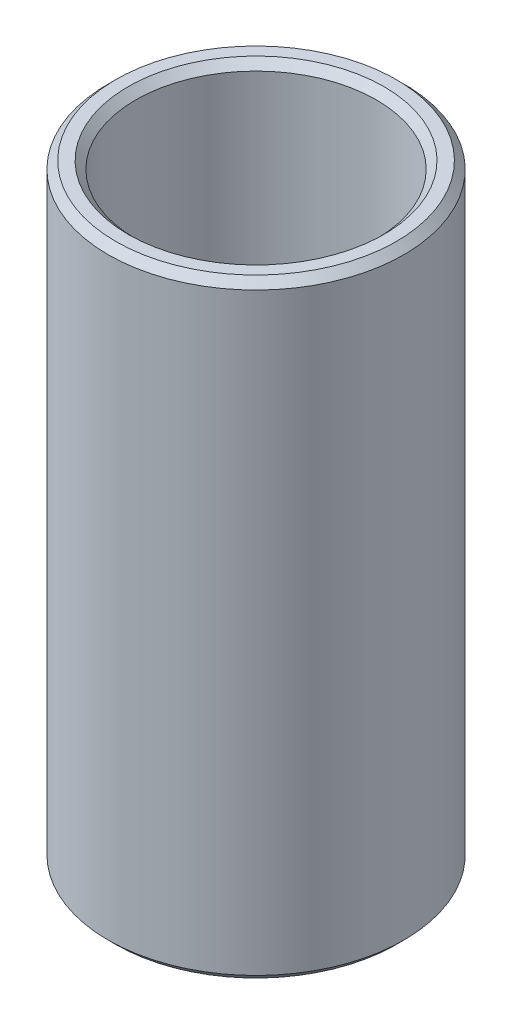
ISO-10303-21;
HEADER;
FILE_DESCRIPTION(('STEP AP214'),'2;1');
FILE_NAME('part.step','',(''),(''),'','','');
FILE_SCHEMA(('AUTOMOTIVE_DESIGN { 1 0 10303 214 1 1 1 1 }'));
ENDSEC;
DATA;
#1=APPLICATION_CONTEXT('core data for automotive mechanical design processes');
#2=APPLICATION_PROTOCOL_DEFINITION('international standard','automotive_design',2000,#1);
#3=PRODUCT_CONTEXT('',#1,'mechanical');
#4=PRODUCT('Part','Part','',(#3));
#5=PRODUCT_RELATED_PRODUCT_CATEGORY('part','',(#4));
#6=PRODUCT_DEFINITION_FORMATION('','',#4);
#7=PRODUCT_DEFINITION_CONTEXT('part definition',#1,'design');
#8=PRODUCT_DEFINITION('design','',#6,#7);
#9=PRODUCT_DEFINITION_SHAPE('','',#8);
#10=(LENGTH_UNIT() NAMED_UNIT(*) SI_UNIT(.MILLI.,.METRE.));
#11=(NAMED_UNIT(*) PLANE_ANGLE_UNIT() SI_UNIT($,.RADIAN.));
#12=(NAMED_UNIT(*) SI_UNIT($,.STERADIAN.) SOLID_ANGLE_UNIT());
#13=UNCERTAINTY_MEASURE_WITH_UNIT(LENGTH_MEASURE(1.E-05),#10,'distance_accuracy_value','');
#14=(GEOMETRIC_REPRESENTATION_CONTEXT(3) GLOBAL_UNCERTAINTY_ASSIGNED_CONTEXT((#13)) GLOBAL_UNIT_ASSIGNED_CONTEXT((#10,
#11,#12)) REPRESENTATION_CONTEXT('',''));
#15=CARTESIAN_POINT('',(0.,0.,0.));
#16=DIRECTION('',(0.,0.,1.));
#17=DIRECTION('',(1.,0.,0.));
#18=AXIS2_PLACEMENT_3D('',#15,#16,#17);
#19=CARTESIAN_POINT('',(0.,164.669746574711,0.));
#20=DIRECTION('',(0.,-1.,0.));
#21=DIRECTION('',(0.,0.,-1.));
#22=AXIS2_PLACEMENT_3D('',#19,#20,#21);
#23=CYLINDRICAL_SURFACE('',#22,40.);
#24=CARTESIAN_POINT('',(0.,2.0623638601491,0.));
#25=DIRECTION('',(0.,1.,0.));
#26=DIRECTION('',(0.,0.,1.));
#27=AXIS2_PLACEMENT_3D('',#24,#25,#26);
#28=CIRCLE('',#27,40.);
#29=CARTESIAN_POINT('',(0.,2.0623638601491,40.));
#30=VERTEX_POINT('',#29);
#31=EDGE_CURVE('E10',#30,#30,#28,.T.);
#32=ORIENTED_EDGE('',*,*,#31,.T.);
#33=EDGE_LOOP('',(#32));
#34=FACE_BOUND('',#33,.T.);
#35=CARTESIAN_POINT('',(0.,162.607382714562,0.));
#36=DIRECTION('',(0.,1.,0.));
#37=DIRECTION('',(0.,0.,1.));
#38=AXIS2_PLACEMENT_3D('',#35,#36,#37);
#39=CIRCLE('',#38,40.);
#40=CARTESIAN_POINT('',(0.,162.607382714562,40.));
#41=VERTEX_POINT('',#40);
#42=EDGE_CURVE('E50',#41,#41,#39,.F.);
#43=ORIENTED_EDGE('',*,*,#42,.T.);
#44=EDGE_LOOP('',(#43));
#45=FACE_BOUND('',#44,.T.);
#46=ADVANCED_FACE('F39',(#34,#45),#23,.T.);
#47=CARTESIAN_POINT('',(0.,164.669746574711,0.));
#48=DIRECTION('',(0.,1.,0.));
#49=DIRECTION('',(0.,0.,1.));
#50=AXIS2_PLACEMENT_3D('',#47,#48,#49);
#51=PLANE('',#50);
#52=CARTESIAN_POINT('',(0.,164.669746574711,0.));
#53=DIRECTION('',(0.,1.,0.));
#54=DIRECTION('',(0.,0.,1.));
#55=AXIS2_PLACEMENT_3D('',#52,#53,#54);
#56=CIRCLE('',#55,34.6121287939865);
#57=CARTESIAN_POINT('',(0.,164.669746574711,34.6121287939865));
#58=VERTEX_POINT('',#57);
#59=EDGE_CURVE('E58',#58,#58,#56,.F.);
#60=ORIENTED_EDGE('',*,*,#59,.T.);
#61=EDGE_LOOP('',(#60));
#62=FACE_BOUND('',#61,.T.);
#63=CARTESIAN_POINT('',(0.,164.669746574711,0.));
#64=DIRECTION('',(0.,1.,0.));
#65=DIRECTION('',(0.,0.,1.));
#66=AXIS2_PLACEMENT_3D('',#63,#64,#65);
#67=CIRCLE('',#66,37.9376361398509);
#68=CARTESIAN_POINT('',(0.,164.669746574711,37.9376361398509));
#69=VERTEX_POINT('',#68);
#70=EDGE_CURVE('E61',#69,#69,#67,.T.);
#71=ORIENTED_EDGE('',*,*,#70,.T.);
#72=EDGE_LOOP('',(#71));
#73=FACE_BOUND('',#72,.T.);
#74=ADVANCED_FACE('F88',(#62,#73),#51,.T.);
#75=CARTESIAN_POINT('',(0.,0.,0.));
#76=DIRECTION('',(0.,1.,0.));
#77=DIRECTION('',(0.,0.,1.));
#78=AXIS2_PLACEMENT_3D('',#75,#76,#77);
#79=PLANE('',#78);
#80=CARTESIAN_POINT('',(0.,0.,0.));
#81=DIRECTION('',(0.,1.,0.));
#82=DIRECTION('',(0.,0.,1.));
#83=AXIS2_PLACEMENT_3D('',#80,#81,#82);
#84=CIRCLE('',#83,34.6121287939865);
#85=CARTESIAN_POINT('',(0.,0.,34.6121287939865));
#86=VERTEX_POINT('',#85);
#87=EDGE_CURVE('E51',#86,#86,#84,.T.);
#88=ORIENTED_EDGE('',*,*,#87,.T.);
#89=EDGE_LOOP('',(#88));
#90=FACE_BOUND('',#89,.T.);
#91=CARTESIAN_POINT('',(0.,0.,0.));
#92=DIRECTION('',(0.,1.,0.));
#93=DIRECTION('',(0.,0.,1.));
#94=AXIS2_PLACEMENT_3D('',#91,#92,#93);
#95=CIRCLE('',#94,37.9376361398509);
#96=CARTESIAN_POINT('',(0.,0.,37.9376361398509));
#97=VERTEX_POINT('',#96);
#98=EDGE_CURVE('E54',#97,#97,#95,.F.);
#99=ORIENTED_EDGE('',*,*,#98,.T.);
#100=EDGE_LOOP('',(#99));
#101=FACE_BOUND('',#100,.T.);
#102=ADVANCED_FACE('F83',(#90,#101),#79,.F.);
#103=CARTESIAN_POINT('',(0.,164.669746574711,0.));
#104=DIRECTION('',(0.,-1.,0.));
#105=DIRECTION('',(0.,0.,-1.));
#106=AXIS2_PLACEMENT_3D('',#103,#104,#105);
#107=CYLINDRICAL_SURFACE('',#106,32.5497649338374);
#108=CARTESIAN_POINT('',(0.,162.607382714562,0.));
#109=DIRECTION('',(0.,1.,0.));
#110=DIRECTION('',(0.,0.,1.));
#111=AXIS2_PLACEMENT_3D('',#108,#109,#110);
#112=CIRCLE('',#111,32.5497649338374);
#113=CARTESIAN_POINT('',(0.,162.607382714562,32.5497649338374));
#114=VERTEX_POINT('',#113);
#115=EDGE_CURVE('E67',#114,#114,#112,.T.);
#116=ORIENTED_EDGE('',*,*,#115,.T.);
#117=EDGE_LOOP('',(#116));
#118=FACE_BOUND('',#117,.T.);
#119=CARTESIAN_POINT('',(0.,2.06236386014907,0.));
#120=DIRECTION('',(0.,1.,0.));
#121=DIRECTION('',(0.,0.,1.));
#122=AXIS2_PLACEMENT_3D('',#119,#120,#121);
#123=CIRCLE('',#122,32.5497649338374);
#124=CARTESIAN_POINT('',(0.,2.06236386014907,32.5497649338374));
#125=VERTEX_POINT('',#124);
#126=EDGE_CURVE('E69',#125,#125,#123,.F.);
#127=ORIENTED_EDGE('',*,*,#126,.T.);
#128=EDGE_LOOP('',(#127));
#129=FACE_BOUND('',#128,.T.);
#130=ADVANCED_FACE('F71',(#118,#129),#107,.F.);
#131=CARTESIAN_POINT('',(0.,162.607382714562,0.));
#132=DIRECTION('',(0.,1.,0.));
#133=DIRECTION('',(0.,0.,1.));
#134=AXIS2_PLACEMENT_3D('',#131,#132,#133);
#135=CONICAL_SURFACE('',#134,32.5497649338374,0.785398163397447);
#136=ORIENTED_EDGE('',*,*,#59,.F.);
#137=EDGE_LOOP('',(#136));
#138=FACE_BOUND('',#137,.T.);
#139=ORIENTED_EDGE('',*,*,#115,.F.);
#140=EDGE_LOOP('',(#139));
#141=FACE_BOUND('',#140,.T.);
#142=ADVANCED_FACE('F77',(#138,#141),#135,.F.);
#143=CARTESIAN_POINT('',(0.,0.,0.));
#144=DIRECTION('',(0.,-1.,0.));
#145=DIRECTION('',(0.,0.,-1.));
#146=AXIS2_PLACEMENT_3D('',#143,#144,#145);
#147=CONICAL_SURFACE('',#146,34.6121287939865,0.78539816339745);
#148=ORIENTED_EDGE('',*,*,#126,.F.);
#149=EDGE_LOOP('',(#148));
#150=FACE_BOUND('',#149,.T.);
#151=ORIENTED_EDGE('',*,*,#87,.F.);
#152=EDGE_LOOP('',(#151));
#153=FACE_BOUND('',#152,.T.);
#154=ADVANCED_FACE('F73',(#150,#153),#147,.F.);
#155=CARTESIAN_POINT('',(0.,2.0623638601491,0.));
#156=DIRECTION('',(0.,1.,0.));
#157=DIRECTION('',(0.,0.,1.));
#158=AXIS2_PLACEMENT_3D('',#155,#156,#157);
#159=CONICAL_SURFACE('',#158,40.,0.785398163397447);
#160=ORIENTED_EDGE('',*,*,#98,.F.);
#161=EDGE_LOOP('',(#160));
#162=FACE_BOUND('',#161,.T.);
#163=ORIENTED_EDGE('',*,*,#31,.F.);
#164=EDGE_LOOP('',(#163));
#165=FACE_BOUND('',#164,.T.);
#166=ADVANCED_FACE('F76',(#162,#165),#159,.T.);
#167=CARTESIAN_POINT('',(0.,164.669746574711,0.));
#168=DIRECTION('',(0.,-1.,0.));
#169=DIRECTION('',(0.,0.,-1.));
#170=AXIS2_PLACEMENT_3D('',#167,#168,#169);
#171=CONICAL_SURFACE('',#170,37.9376361398509,0.785398163397447);
#172=ORIENTED_EDGE('',*,*,#42,.F.);
#173=EDGE_LOOP('',(#172));
#174=FACE_BOUND('',#173,.T.);
#175=ORIENTED_EDGE('',*,*,#70,.F.);
#176=EDGE_LOOP('',(#175));
#177=FACE_BOUND('',#176,.T.);
#178=ADVANCED_FACE('F45',(#174,#177),#171,.T.);
#179=CLOSED_SHELL('',(#46,#74,#102,#130,#142,#154,#166,#178));
#180=MANIFOLD_SOLID_BREP('B2',#179);
#181=ADVANCED_BREP_SHAPE_REPRESENTATION('',(#18,#180),#14);
#182=SHAPE_DEFINITION_REPRESENTATION(#9,#181);
ENDSEC;
END-ISO-10303-21;
